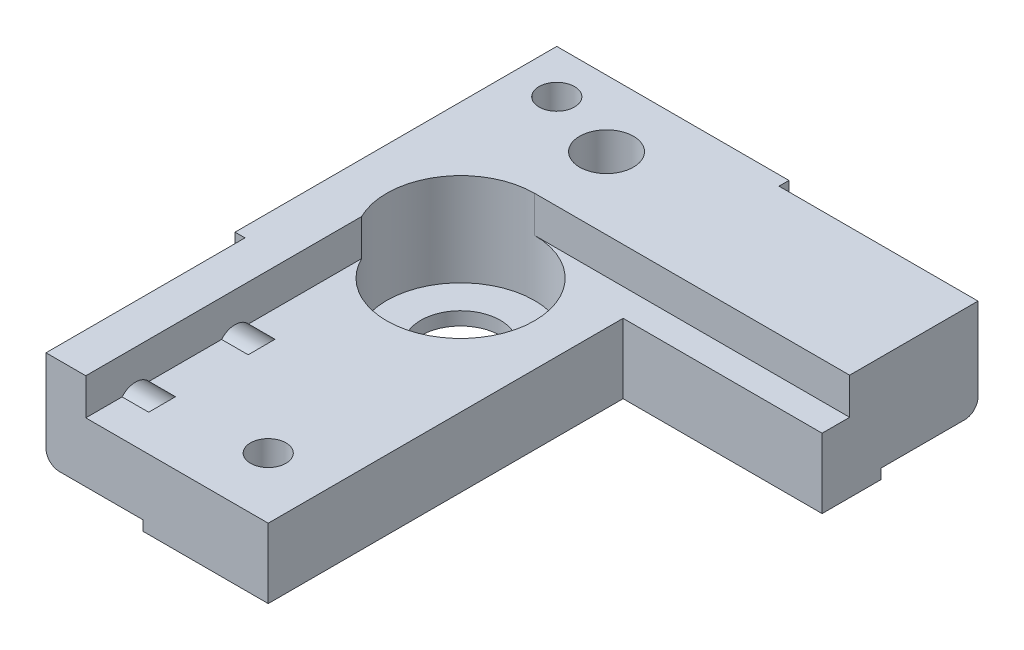
ISO-10303-21;
HEADER;
FILE_DESCRIPTION(('STEP AP214'),'2;1');
FILE_NAME('part.step','',(''),(''),'','','');
FILE_SCHEMA(('AUTOMOTIVE_DESIGN { 1 0 10303 214 1 1 1 1 }'));
ENDSEC;
DATA;
#1=APPLICATION_CONTEXT('core data for automotive mechanical design processes');
#2=APPLICATION_PROTOCOL_DEFINITION('international standard','automotive_design',2000,#1);
#3=PRODUCT_CONTEXT('',#1,'mechanical');
#4=PRODUCT('Part','Part','',(#3));
#5=PRODUCT_RELATED_PRODUCT_CATEGORY('part','',(#4));
#6=PRODUCT_DEFINITION_FORMATION('','',#4);
#7=PRODUCT_DEFINITION_CONTEXT('part definition',#1,'design');
#8=PRODUCT_DEFINITION('design','',#6,#7);
#9=PRODUCT_DEFINITION_SHAPE('','',#8);
#10=(LENGTH_UNIT() NAMED_UNIT(*) SI_UNIT(.MILLI.,.METRE.));
#11=(NAMED_UNIT(*) PLANE_ANGLE_UNIT() SI_UNIT($,.RADIAN.));
#12=(NAMED_UNIT(*) SI_UNIT($,.STERADIAN.) SOLID_ANGLE_UNIT());
#13=UNCERTAINTY_MEASURE_WITH_UNIT(LENGTH_MEASURE(1.E-05),#10,'distance_accuracy_value','');
#14=(GEOMETRIC_REPRESENTATION_CONTEXT(3) GLOBAL_UNCERTAINTY_ASSIGNED_CONTEXT((#13)) GLOBAL_UNIT_ASSIGNED_CONTEXT((#10,
#11,#12)) REPRESENTATION_CONTEXT('',''));
#15=CARTESIAN_POINT('',(0.,0.,0.));
#16=DIRECTION('',(0.,0.,1.));
#17=DIRECTION('',(1.,0.,0.));
#18=AXIS2_PLACEMENT_3D('',#15,#16,#17);
#19=CARTESIAN_POINT('',(35.,16.,78.5));
#20=DIRECTION('',(-1.,0.,0.));
#21=DIRECTION('',(0.,0.,1.));
#22=AXIS2_PLACEMENT_3D('',#19,#20,#21);
#23=PLANE('',#22);
#24=DIRECTION('',(0.,0.,-1.));
#25=VECTOR('',#24,1.);
#26=CARTESIAN_POINT('',(35.,10.5,78.5));
#27=LINE('',#26,#25);
#28=CARTESIAN_POINT('',(35.,10.5,78.5));
#29=VERTEX_POINT('',#28);
#30=CARTESIAN_POINT('',(35.,10.5,25.));
#31=VERTEX_POINT('',#30);
#32=EDGE_CURVE('E207',#29,#31,#27,.T.);
#33=ORIENTED_EDGE('',*,*,#32,.F.);
#34=DIRECTION('',(0.,-1.,0.));
#35=VECTOR('',#34,1.);
#36=CARTESIAN_POINT('',(35.,16.,78.5));
#37=LINE('',#36,#35);
#38=CARTESIAN_POINT('',(35.,0.,78.5));
#39=VERTEX_POINT('',#38);
#40=EDGE_CURVE('E214',#29,#39,#37,.T.);
#41=ORIENTED_EDGE('',*,*,#40,.T.);
#42=DIRECTION('',(0.,0.,-1.));
#43=VECTOR('',#42,1.);
#44=CARTESIAN_POINT('',(35.,0.,78.5));
#45=LINE('',#44,#43);
#46=CARTESIAN_POINT('',(35.,0.,25.));
#47=VERTEX_POINT('',#46);
#48=EDGE_CURVE('E213',#39,#47,#45,.T.);
#49=ORIENTED_EDGE('',*,*,#48,.T.);
#50=DIRECTION('',(0.,-1.,0.));
#51=VECTOR('',#50,1.);
#52=CARTESIAN_POINT('',(35.,16.,25.));
#53=LINE('',#52,#51);
#54=EDGE_CURVE('E199',#31,#47,#53,.T.);
#55=ORIENTED_EDGE('',*,*,#54,.F.);
#56=EDGE_LOOP('',(#33,#41,#49,#55));
#57=FACE_BOUND('',#56,.T.);
#58=ADVANCED_FACE('F35',(#57),#23,.F.);
#59=CARTESIAN_POINT('',(35.,16.,25.));
#60=DIRECTION('',(0.,0.,-1.));
#61=DIRECTION('',(-1.,0.,0.));
#62=AXIS2_PLACEMENT_3D('',#59,#60,#61);
#63=PLANE('',#62);
#64=DIRECTION('',(1.,0.,0.));
#65=VECTOR('',#64,1.);
#66=CARTESIAN_POINT('',(65.,10.5,25.));
#67=LINE('',#66,#65);
#68=CARTESIAN_POINT('',(65.,10.5,25.));
#69=VERTEX_POINT('',#68);
#70=EDGE_CURVE('E195',#31,#69,#67,.T.);
#71=ORIENTED_EDGE('',*,*,#70,.F.);
#72=ORIENTED_EDGE('',*,*,#54,.T.);
#73=DIRECTION('',(1.,0.,0.));
#74=VECTOR('',#73,1.);
#75=CARTESIAN_POINT('',(35.,0.,25.));
#76=LINE('',#75,#74);
#77=CARTESIAN_POINT('',(65.,0.,25.));
#78=VERTEX_POINT('',#77);
#79=EDGE_CURVE('E393',#47,#78,#76,.T.);
#80=ORIENTED_EDGE('',*,*,#79,.T.);
#81=DIRECTION('',(0.,-1.,0.));
#82=VECTOR('',#81,1.);
#83=CARTESIAN_POINT('',(65.,16.,25.));
#84=LINE('',#83,#82);
#85=EDGE_CURVE('E202',#69,#78,#84,.T.);
#86=ORIENTED_EDGE('',*,*,#85,.F.);
#87=EDGE_LOOP('',(#71,#72,#80,#86));
#88=FACE_BOUND('',#87,.T.);
#89=ADVANCED_FACE('F197',(#88),#63,.F.);
#90=CARTESIAN_POINT('',(11.5,8.75,56.));
#91=DIRECTION('',(-1.,0.,0.));
#92=DIRECTION('',(0.,-1.,0.));
#93=AXIS2_PLACEMENT_3D('',#90,#91,#92);
#94=CYLINDRICAL_SURFACE('',#93,2.675);
#95=CARTESIAN_POINT('',(1.5,8.75,56.));
#96=DIRECTION('',(-1.,0.,0.));
#97=DIRECTION('',(0.,-1.,0.));
#98=AXIS2_PLACEMENT_3D('',#95,#96,#97);
#99=CIRCLE('',#98,2.675);
#100=CARTESIAN_POINT('',(1.5,6.075,56.));
#101=VERTEX_POINT('',#100);
#102=EDGE_CURVE('E282',#101,#101,#99,.T.);
#103=ORIENTED_EDGE('',*,*,#102,.T.);
#104=EDGE_LOOP('',(#103));
#105=FACE_BOUND('',#104,.T.);
#106=DIRECTION('',(-1.,0.,0.));
#107=VECTOR('',#106,1.);
#108=CARTESIAN_POINT('',(11.5,10.5,53.9768526993815));
#109=LINE('',#108,#107);
#110=CARTESIAN_POINT('',(7.50000000000001,10.5,53.9768526993815));
#111=VERTEX_POINT('',#110);
#112=CARTESIAN_POINT('',(11.5,10.5,53.9768526993815));
#113=VERTEX_POINT('',#112);
#114=EDGE_CURVE('E258',#111,#113,#109,.F.);
#115=ORIENTED_EDGE('',*,*,#114,.F.);
#116=CARTESIAN_POINT('',(7.50000000000001,8.75,56.));
#117=DIRECTION('',(-1.,0.,0.));
#118=DIRECTION('',(0.,0.,1.));
#119=AXIS2_PLACEMENT_3D('',#116,#117,#118);
#120=CIRCLE('',#119,2.675);
#121=CARTESIAN_POINT('',(7.50000000000001,10.5,58.0231473006185));
#122=VERTEX_POINT('',#121);
#123=EDGE_CURVE('E263',#111,#122,#120,.F.);
#124=ORIENTED_EDGE('',*,*,#123,.T.);
#125=DIRECTION('',(-1.,0.,0.));
#126=VECTOR('',#125,1.);
#127=CARTESIAN_POINT('',(11.5,10.5,58.0231473006185));
#128=LINE('',#127,#126);
#129=CARTESIAN_POINT('',(11.5,10.5,58.0231473006185));
#130=VERTEX_POINT('',#129);
#131=EDGE_CURVE('E255',#130,#122,#128,.T.);
#132=ORIENTED_EDGE('',*,*,#131,.F.);
#133=CARTESIAN_POINT('',(11.5,8.75,56.));
#134=DIRECTION('',(-1.,0.,0.));
#135=DIRECTION('',(0.,-1.,0.));
#136=AXIS2_PLACEMENT_3D('',#133,#134,#135);
#137=CIRCLE('',#136,2.675);
#138=EDGE_CURVE('E285',#113,#130,#137,.T.);
#139=ORIENTED_EDGE('',*,*,#138,.F.);
#140=EDGE_LOOP('',(#115,#124,#132,#139));
#141=FACE_BOUND('',#140,.T.);
#142=ADVANCED_FACE('F497',(#105,#141),#94,.F.);
#143=CARTESIAN_POINT('',(11.5,8.75,56.));
#144=DIRECTION('',(-1.,0.,0.));
#145=DIRECTION('',(0.,-1.,0.));
#146=AXIS2_PLACEMENT_3D('',#143,#144,#145);
#147=PLANE('',#146);
#148=ORIENTED_EDGE('',*,*,#138,.T.);
#149=DIRECTION('',(0.,0.,-1.));
#150=VECTOR('',#149,1.);
#151=CARTESIAN_POINT('',(11.5,10.5,56.));
#152=LINE('',#151,#150);
#153=EDGE_CURVE('E253',#130,#113,#152,.T.);
#154=ORIENTED_EDGE('',*,*,#153,.T.);
#155=EDGE_LOOP('',(#148,#154));
#156=FACE_BOUND('',#155,.T.);
#157=ADVANCED_FACE('F565',(#156),#147,.T.);
#158=CARTESIAN_POINT('',(11.5,8.75,71.));
#159=DIRECTION('',(-1.,0.,0.));
#160=DIRECTION('',(0.,-1.,0.));
#161=AXIS2_PLACEMENT_3D('',#158,#159,#160);
#162=CYLINDRICAL_SURFACE('',#161,2.675);
#163=CARTESIAN_POINT('',(1.5,8.75,71.));
#164=DIRECTION('',(-1.,0.,0.));
#165=DIRECTION('',(0.,-1.,0.));
#166=AXIS2_PLACEMENT_3D('',#163,#164,#165);
#167=CIRCLE('',#166,2.675);
#168=CARTESIAN_POINT('',(1.5,6.075,71.));
#169=VERTEX_POINT('',#168);
#170=EDGE_CURVE('E276',#169,#169,#167,.T.);
#171=ORIENTED_EDGE('',*,*,#170,.T.);
#172=EDGE_LOOP('',(#171));
#173=FACE_BOUND('',#172,.T.);
#174=DIRECTION('',(-1.,0.,0.));
#175=VECTOR('',#174,1.);
#176=CARTESIAN_POINT('',(11.5,10.5,68.9768526993815));
#177=LINE('',#176,#175);
#178=CARTESIAN_POINT('',(7.50000000000001,10.5,68.9768526993815));
#179=VERTEX_POINT('',#178);
#180=CARTESIAN_POINT('',(11.5,10.5,68.9768526993815));
#181=VERTEX_POINT('',#180);
#182=EDGE_CURVE('E250',#179,#181,#177,.F.);
#183=ORIENTED_EDGE('',*,*,#182,.F.);
#184=CARTESIAN_POINT('',(7.50000000000001,8.75,71.));
#185=DIRECTION('',(-1.,0.,0.));
#186=DIRECTION('',(0.,0.,1.));
#187=AXIS2_PLACEMENT_3D('',#184,#185,#186);
#188=CIRCLE('',#187,2.675);
#189=CARTESIAN_POINT('',(7.50000000000001,10.5,73.0231473006185));
#190=VERTEX_POINT('',#189);
#191=EDGE_CURVE('E408',#179,#190,#188,.F.);
#192=ORIENTED_EDGE('',*,*,#191,.T.);
#193=DIRECTION('',(-1.,0.,0.));
#194=VECTOR('',#193,1.);
#195=CARTESIAN_POINT('',(11.5,10.5,73.0231473006185));
#196=LINE('',#195,#194);
#197=CARTESIAN_POINT('',(11.5,10.5,73.0231473006185));
#198=VERTEX_POINT('',#197);
#199=EDGE_CURVE('E247',#198,#190,#196,.T.);
#200=ORIENTED_EDGE('',*,*,#199,.F.);
#201=CARTESIAN_POINT('',(11.5,8.75,71.));
#202=DIRECTION('',(-1.,0.,0.));
#203=DIRECTION('',(0.,-1.,0.));
#204=AXIS2_PLACEMENT_3D('',#201,#202,#203);
#205=CIRCLE('',#204,2.675);
#206=EDGE_CURVE('E279',#181,#198,#205,.T.);
#207=ORIENTED_EDGE('',*,*,#206,.F.);
#208=EDGE_LOOP('',(#183,#192,#200,#207));
#209=FACE_BOUND('',#208,.T.);
#210=ADVANCED_FACE('F569',(#173,#209),#162,.F.);
#211=CARTESIAN_POINT('',(11.5,8.75,71.));
#212=DIRECTION('',(-1.,0.,0.));
#213=DIRECTION('',(0.,-1.,0.));
#214=AXIS2_PLACEMENT_3D('',#211,#212,#213);
#215=PLANE('',#214);
#216=ORIENTED_EDGE('',*,*,#206,.T.);
#217=DIRECTION('',(0.,0.,-1.));
#218=VECTOR('',#217,1.);
#219=CARTESIAN_POINT('',(11.5,10.5,71.));
#220=LINE('',#219,#218);
#221=EDGE_CURVE('E245',#198,#181,#220,.T.);
#222=ORIENTED_EDGE('',*,*,#221,.T.);
#223=EDGE_LOOP('',(#216,#222));
#224=FACE_BOUND('',#223,.T.);
#225=ADVANCED_FACE('F489',(#224),#215,.T.);
#226=CARTESIAN_POINT('',(25.8455481504227,0.,69.3455481504227));
#227=DIRECTION('',(0.,1.,0.));
#228=DIRECTION('',(0.,0.,1.));
#229=AXIS2_PLACEMENT_3D('',#226,#227,#228);
#230=CYLINDRICAL_SURFACE('',#229,2.675);
#231=CARTESIAN_POINT('',(25.8455481504227,0.,69.3455481504227));
#232=DIRECTION('',(0.,1.,0.));
#233=DIRECTION('',(0.,0.,1.));
#234=AXIS2_PLACEMENT_3D('',#231,#232,#233);
#235=CIRCLE('',#234,2.675);
#236=CARTESIAN_POINT('',(25.8455481504227,0.,72.0205481504227));
#237=VERTEX_POINT('',#236);
#238=EDGE_CURVE('E269',#237,#237,#235,.T.);
#239=ORIENTED_EDGE('',*,*,#238,.F.);
#240=EDGE_LOOP('',(#239));
#241=FACE_BOUND('',#240,.T.);
#242=CARTESIAN_POINT('',(25.8455481504227,10.5,69.3455481504227));
#243=DIRECTION('',(0.,1.,0.));
#244=DIRECTION('',(0.,0.,1.));
#245=AXIS2_PLACEMENT_3D('',#242,#243,#244);
#246=CIRCLE('',#245,2.675);
#247=CARTESIAN_POINT('',(25.8455481504227,10.5,72.0205481504227));
#248=VERTEX_POINT('',#247);
#249=EDGE_CURVE('E240',#248,#248,#246,.F.);
#250=ORIENTED_EDGE('',*,*,#249,.F.);
#251=EDGE_LOOP('',(#250));
#252=FACE_BOUND('',#251,.T.);
#253=ADVANCED_FACE('F482',(#241,#252),#230,.F.);
#254=CARTESIAN_POINT('',(0.,16.,0.));
#255=DIRECTION('',(1.,0.,0.));
#256=DIRECTION('',(0.,0.,-1.));
#257=AXIS2_PLACEMENT_3D('',#254,#255,#256);
#258=PLANE('',#257);
#259=DIRECTION('',(0.,0.,1.));
#260=VECTOR('',#259,1.);
#261=CARTESIAN_POINT('',(0.,0.,0.));
#262=LINE('',#261,#260);
#263=CARTESIAN_POINT('',(0.,0.,0.));
#264=VERTEX_POINT('',#263);
#265=CARTESIAN_POINT('',(0.,0.,48.5));
#266=VERTEX_POINT('',#265);
#267=EDGE_CURVE('E372',#264,#266,#262,.T.);
#268=ORIENTED_EDGE('',*,*,#267,.T.);
#269=DIRECTION('',(0.,-1.,0.));
#270=VECTOR('',#269,1.);
#271=CARTESIAN_POINT('',(0.,0.,48.5));
#272=LINE('',#271,#270);
#273=CARTESIAN_POINT('',(0.,16.,48.5));
#274=VERTEX_POINT('',#273);
#275=EDGE_CURVE('E301',#274,#266,#272,.T.);
#276=ORIENTED_EDGE('',*,*,#275,.F.);
#277=DIRECTION('',(0.,0.,1.));
#278=VECTOR('',#277,1.);
#279=CARTESIAN_POINT('',(0.,16.,0.));
#280=LINE('',#279,#278);
#281=CARTESIAN_POINT('',(0.,16.,0.));
#282=VERTEX_POINT('',#281);
#283=EDGE_CURVE('E375',#282,#274,#280,.T.);
#284=ORIENTED_EDGE('',*,*,#283,.F.);
#285=DIRECTION('',(0.,-1.,0.));
#286=VECTOR('',#285,1.);
#287=CARTESIAN_POINT('',(0.,16.,0.));
#288=LINE('',#287,#286);
#289=EDGE_CURVE('E387',#282,#264,#288,.T.);
#290=ORIENTED_EDGE('',*,*,#289,.T.);
#291=EDGE_LOOP('',(#268,#276,#284,#290));
#292=FACE_BOUND('',#291,.T.);
#293=ADVANCED_FACE('F480',(#292),#258,.F.);
#294=CARTESIAN_POINT('',(0.,16.,78.5));
#295=DIRECTION('',(0.,0.,-1.));
#296=DIRECTION('',(-1.,0.,0.));
#297=AXIS2_PLACEMENT_3D('',#294,#295,#296);
#298=PLANE('',#297);
#299=DIRECTION('',(0.,1.,0.));
#300=VECTOR('',#299,1.);
#301=CARTESIAN_POINT('',(1.5,16.1,78.5));
#302=LINE('',#301,#300);
#303=CARTESIAN_POINT('',(1.5,3.5,78.5));
#304=VERTEX_POINT('',#303);
#305=CARTESIAN_POINT('',(1.5,16.,78.5));
#306=VERTEX_POINT('',#305);
#307=EDGE_CURVE('E295',#304,#306,#302,.T.);
#308=ORIENTED_EDGE('',*,*,#307,.F.);
#309=CARTESIAN_POINT('',(3.5,3.5,78.5));
#310=DIRECTION('',(0.,0.,-1.));
#311=DIRECTION('',(-1.,0.,0.));
#312=AXIS2_PLACEMENT_3D('',#309,#310,#311);
#313=CIRCLE('',#312,2.);
#314=CARTESIAN_POINT('',(3.5,1.5,78.5));
#315=VERTEX_POINT('',#314);
#316=EDGE_CURVE('E423',#304,#315,#313,.F.);
#317=ORIENTED_EDGE('',*,*,#316,.T.);
#318=DIRECTION('',(-1.,0.,0.));
#319=VECTOR('',#318,1.);
#320=CARTESIAN_POINT('',(1.5,1.5,78.5));
#321=LINE('',#320,#319);
#322=CARTESIAN_POINT('',(16.1,1.5,78.5));
#323=VERTEX_POINT('',#322);
#324=EDGE_CURVE('E307',#323,#315,#321,.T.);
#325=ORIENTED_EDGE('',*,*,#324,.F.);
#326=DIRECTION('',(0.,1.,0.));
#327=VECTOR('',#326,1.);
#328=CARTESIAN_POINT('',(16.1,1.5,78.5));
#329=LINE('',#328,#327);
#330=CARTESIAN_POINT('',(16.1,0.,78.5));
#331=VERTEX_POINT('',#330);
#332=EDGE_CURVE('E288',#331,#323,#329,.T.);
#333=ORIENTED_EDGE('',*,*,#332,.F.);
#334=DIRECTION('',(1.,0.,0.));
#335=VECTOR('',#334,1.);
#336=CARTESIAN_POINT('',(0.,0.,78.5));
#337=LINE('',#336,#335);
#338=EDGE_CURVE('E390',#331,#39,#337,.T.);
#339=ORIENTED_EDGE('',*,*,#338,.T.);
#340=ORIENTED_EDGE('',*,*,#40,.F.);
#341=DIRECTION('',(1.,0.,0.));
#342=VECTOR('',#341,1.);
#343=CARTESIAN_POINT('',(35.,10.5,78.5));
#344=LINE('',#343,#342);
#345=CARTESIAN_POINT('',(7.50000000000001,10.5,78.5));
#346=VERTEX_POINT('',#345);
#347=EDGE_CURVE('E219',#346,#29,#344,.T.);
#348=ORIENTED_EDGE('',*,*,#347,.F.);
#349=DIRECTION('',(0.,1.,0.));
#350=VECTOR('',#349,1.);
#351=CARTESIAN_POINT('',(7.50000000000001,10.5,78.5));
#352=LINE('',#351,#350);
#353=CARTESIAN_POINT('',(7.50000000000001,16.,78.5));
#354=VERTEX_POINT('',#353);
#355=EDGE_CURVE('E237',#346,#354,#352,.T.);
#356=ORIENTED_EDGE('',*,*,#355,.T.);
#357=DIRECTION('',(1.,0.,0.));
#358=VECTOR('',#357,1.);
#359=CARTESIAN_POINT('',(0.,16.,78.5));
#360=LINE('',#359,#358);
#361=EDGE_CURVE('E378',#306,#354,#360,.T.);
#362=ORIENTED_EDGE('',*,*,#361,.F.);
#363=EDGE_LOOP('',(#308,#317,#325,#333,#339,#340,#348,#356,#362));
#364=FACE_BOUND('',#363,.T.);
#365=ADVANCED_FACE('F471',(#364),#298,.F.);
#366=CARTESIAN_POINT('',(65.,16.,0.));
#367=DIRECTION('',(-1.,0.,0.));
#368=DIRECTION('',(0.,0.,1.));
#369=AXIS2_PLACEMENT_3D('',#366,#367,#368);
#370=PLANE('',#369);
#371=DIRECTION('',(0.,0.,1.));
#372=VECTOR('',#371,1.);
#373=CARTESIAN_POINT('',(65.,1.5,16.1));
#374=LINE('',#373,#372);
#375=CARTESIAN_POINT('',(65.,1.5,3.49999999999999));
#376=VERTEX_POINT('',#375);
#377=CARTESIAN_POINT('',(65.,1.5,16.1));
#378=VERTEX_POINT('',#377);
#379=EDGE_CURVE('E345',#376,#378,#374,.T.);
#380=ORIENTED_EDGE('',*,*,#379,.F.);
#381=CARTESIAN_POINT('',(65.,3.5,3.49999999999999));
#382=DIRECTION('',(-1.,0.,0.));
#383=DIRECTION('',(0.,0.,1.));
#384=AXIS2_PLACEMENT_3D('',#381,#382,#383);
#385=CIRCLE('',#384,2.);
#386=CARTESIAN_POINT('',(65.,3.5,1.49999999999999));
#387=VERTEX_POINT('',#386);
#388=EDGE_CURVE('E415',#376,#387,#385,.F.);
#389=ORIENTED_EDGE('',*,*,#388,.T.);
#390=DIRECTION('',(0.,-1.,0.));
#391=VECTOR('',#390,1.);
#392=CARTESIAN_POINT('',(65.,1.5,1.49999999999999));
#393=LINE('',#392,#391);
#394=CARTESIAN_POINT('',(65.,16.,1.49999999999999));
#395=VERTEX_POINT('',#394);
#396=EDGE_CURVE('E326',#395,#387,#393,.T.);
#397=ORIENTED_EDGE('',*,*,#396,.F.);
#398=DIRECTION('',(0.,0.,-1.));
#399=VECTOR('',#398,1.);
#400=CARTESIAN_POINT('',(65.,16.,0.));
#401=LINE('',#400,#399);
#402=CARTESIAN_POINT('',(65.,16.,20.85));
#403=VERTEX_POINT('',#402);
#404=EDGE_CURVE('E382',#403,#395,#401,.T.);
#405=ORIENTED_EDGE('',*,*,#404,.F.);
#406=DIRECTION('',(0.,1.,0.));
#407=VECTOR('',#406,1.);
#408=CARTESIAN_POINT('',(65.,10.5,20.85));
#409=LINE('',#408,#407);
#410=CARTESIAN_POINT('',(65.,10.5,20.85));
#411=VERTEX_POINT('',#410);
#412=EDGE_CURVE('E234',#411,#403,#409,.T.);
#413=ORIENTED_EDGE('',*,*,#412,.F.);
#414=DIRECTION('',(0.,0.,-1.));
#415=VECTOR('',#414,1.);
#416=CARTESIAN_POINT('',(65.,10.5,20.85));
#417=LINE('',#416,#415);
#418=EDGE_CURVE('E206',#69,#411,#417,.T.);
#419=ORIENTED_EDGE('',*,*,#418,.F.);
#420=ORIENTED_EDGE('',*,*,#85,.T.);
#421=DIRECTION('',(0.,0.,-1.));
#422=VECTOR('',#421,1.);
#423=CARTESIAN_POINT('',(65.,0.,0.));
#424=LINE('',#423,#422);
#425=CARTESIAN_POINT('',(65.,0.,16.1));
#426=VERTEX_POINT('',#425);
#427=EDGE_CURVE('E395',#78,#426,#424,.T.);
#428=ORIENTED_EDGE('',*,*,#427,.T.);
#429=DIRECTION('',(0.,-1.,0.));
#430=VECTOR('',#429,1.);
#431=CARTESIAN_POINT('',(65.,0.,16.1));
#432=LINE('',#431,#430);
#433=EDGE_CURVE('E332',#378,#426,#432,.T.);
#434=ORIENTED_EDGE('',*,*,#433,.F.);
#435=EDGE_LOOP('',(#380,#389,#397,#405,#413,#419,#420,#428,#434));
#436=FACE_BOUND('',#435,.T.);
#437=ADVANCED_FACE('F466',(#436),#370,.F.);
#438=CARTESIAN_POINT('',(0.,16.,0.));
#439=DIRECTION('',(0.,0.,1.));
#440=DIRECTION('',(1.,0.,0.));
#441=AXIS2_PLACEMENT_3D('',#438,#439,#440);
#442=PLANE('',#441);
#443=DIRECTION('',(-1.,0.,0.));
#444=VECTOR('',#443,1.);
#445=CARTESIAN_POINT('',(0.,16.,0.));
#446=LINE('',#445,#444);
#447=CARTESIAN_POINT('',(35.,16.,0.));
#448=VERTEX_POINT('',#447);
#449=EDGE_CURVE('E385',#448,#282,#446,.T.);
#450=ORIENTED_EDGE('',*,*,#449,.F.);
#451=DIRECTION('',(0.,1.,0.));
#452=VECTOR('',#451,1.);
#453=CARTESIAN_POINT('',(35.,16.1,0.));
#454=LINE('',#453,#452);
#455=CARTESIAN_POINT('',(35.,0.,0.));
#456=VERTEX_POINT('',#455);
#457=EDGE_CURVE('E331',#456,#448,#454,.T.);
#458=ORIENTED_EDGE('',*,*,#457,.F.);
#459=DIRECTION('',(-1.,0.,0.));
#460=VECTOR('',#459,1.);
#461=CARTESIAN_POINT('',(0.,0.,0.));
#462=LINE('',#461,#460);
#463=EDGE_CURVE('E379',#456,#264,#462,.T.);
#464=ORIENTED_EDGE('',*,*,#463,.T.);
#465=ORIENTED_EDGE('',*,*,#289,.F.);
#466=EDGE_LOOP('',(#450,#458,#464,#465));
#467=FACE_BOUND('',#466,.T.);
#468=ADVANCED_FACE('F452',(#467),#442,.F.);
#469=CARTESIAN_POINT('',(0.,16.,0.));
#470=DIRECTION('',(0.,1.,0.));
#471=DIRECTION('',(0.,0.,1.));
#472=AXIS2_PLACEMENT_3D('',#469,#470,#471);
#473=PLANE('',#472);
#474=DIRECTION('',(0.,0.,1.));
#475=VECTOR('',#474,1.);
#476=CARTESIAN_POINT('',(7.50000000000001,16.,78.5));
#477=LINE('',#476,#475);
#478=CARTESIAN_POINT('',(7.50000000000001,16.,36.9317846668321));
#479=VERTEX_POINT('',#478);
#480=EDGE_CURVE('E221',#479,#354,#477,.T.);
#481=ORIENTED_EDGE('',*,*,#480,.F.);
#482=CARTESIAN_POINT('',(17.5,16.,32.));
#483=DIRECTION('',(0.,1.,0.));
#484=DIRECTION('',(0.,0.,1.));
#485=AXIS2_PLACEMENT_3D('',#482,#483,#484);
#486=CIRCLE('',#485,11.15);
#487=CARTESIAN_POINT('',(17.5,16.,20.85));
#488=VERTEX_POINT('',#487);
#489=EDGE_CURVE('E366',#488,#479,#486,.T.);
#490=ORIENTED_EDGE('',*,*,#489,.F.);
#491=DIRECTION('',(-1.,0.,0.));
#492=VECTOR('',#491,1.);
#493=CARTESIAN_POINT('',(17.5,16.,20.85));
#494=LINE('',#493,#492);
#495=EDGE_CURVE('E223',#403,#488,#494,.T.);
#496=ORIENTED_EDGE('',*,*,#495,.F.);
#497=ORIENTED_EDGE('',*,*,#404,.T.);
#498=DIRECTION('',(1.,0.,0.));
#499=VECTOR('',#498,1.);
#500=CARTESIAN_POINT('',(0.,16.,1.49999999999999));
#501=LINE('',#500,#499);
#502=CARTESIAN_POINT('',(35.,16.,1.49999999999999));
#503=VERTEX_POINT('',#502);
#504=EDGE_CURVE('E403',#503,#395,#501,.T.);
#505=ORIENTED_EDGE('',*,*,#504,.F.);
#506=DIRECTION('',(0.,0.,1.));
#507=VECTOR('',#506,1.);
#508=CARTESIAN_POINT('',(35.,16.,0.));
#509=LINE('',#508,#507);
#510=EDGE_CURVE('E352',#448,#503,#509,.T.);
#511=ORIENTED_EDGE('',*,*,#510,.F.);
#512=ORIENTED_EDGE('',*,*,#449,.T.);
#513=ORIENTED_EDGE('',*,*,#283,.T.);
#514=DIRECTION('',(-1.,0.,0.));
#515=VECTOR('',#514,1.);
#516=CARTESIAN_POINT('',(0.,16.,48.5));
#517=LINE('',#516,#515);
#518=CARTESIAN_POINT('',(1.5,16.,48.5));
#519=VERTEX_POINT('',#518);
#520=EDGE_CURVE('E313',#519,#274,#517,.T.);
#521=ORIENTED_EDGE('',*,*,#520,.F.);
#522=DIRECTION('',(0.,0.,-1.));
#523=VECTOR('',#522,1.);
#524=CARTESIAN_POINT('',(1.5,16.,0.));
#525=LINE('',#524,#523);
#526=EDGE_CURVE('E405',#306,#519,#525,.T.);
#527=ORIENTED_EDGE('',*,*,#526,.F.);
#528=ORIENTED_EDGE('',*,*,#361,.T.);
#529=EDGE_LOOP('',(#481,#490,#496,#497,#505,#511,#512,#513,#521,#527,#528));
#530=FACE_BOUND('',#529,.T.);
#531=CARTESIAN_POINT('',(6.58093689720364,16.,6.58093689720363));
#532=DIRECTION('',(0.,1.,0.));
#533=DIRECTION('',(0.,0.,1.));
#534=AXIS2_PLACEMENT_3D('',#531,#532,#533);
#535=CIRCLE('',#534,2.675);
#536=CARTESIAN_POINT('',(6.58093689720364,16.,9.25593689720364));
#537=VERTEX_POINT('',#536);
#538=EDGE_CURVE('E272',#537,#537,#535,.T.);
#539=ORIENTED_EDGE('',*,*,#538,.F.);
#540=EDGE_LOOP('',(#539));
#541=FACE_BOUND('',#540,.T.);
#542=CARTESIAN_POINT('',(17.5,16.,10.));
#543=DIRECTION('',(0.,1.,0.));
#544=DIRECTION('',(0.,0.,1.));
#545=AXIS2_PLACEMENT_3D('',#542,#543,#544);
#546=CIRCLE('',#545,4.04999999999999);
#547=CARTESIAN_POINT('',(17.5,16.,14.05));
#548=VERTEX_POINT('',#547);
#549=EDGE_CURVE('E356',#548,#548,#546,.T.);
#550=ORIENTED_EDGE('',*,*,#549,.F.);
#551=EDGE_LOOP('',(#550));
#552=FACE_BOUND('',#551,.T.);
#553=ADVANCED_FACE('F456',(#530,#541,#552),#473,.T.);
#554=CARTESIAN_POINT('',(0.,0.,0.));
#555=DIRECTION('',(0.,1.,0.));
#556=DIRECTION('',(0.,0.,1.));
#557=AXIS2_PLACEMENT_3D('',#554,#555,#556);
#558=PLANE('',#557);
#559=ORIENTED_EDGE('',*,*,#238,.T.);
#560=EDGE_LOOP('',(#559));
#561=FACE_BOUND('',#560,.T.);
#562=CARTESIAN_POINT('',(6.58093689720364,0.,6.58093689720363));
#563=DIRECTION('',(0.,1.,0.));
#564=DIRECTION('',(0.,0.,1.));
#565=AXIS2_PLACEMENT_3D('',#562,#563,#564);
#566=CIRCLE('',#565,2.675);
#567=CARTESIAN_POINT('',(6.58093689720364,0.,9.25593689720364));
#568=VERTEX_POINT('',#567);
#569=EDGE_CURVE('E273',#568,#568,#566,.T.);
#570=ORIENTED_EDGE('',*,*,#569,.T.);
#571=EDGE_LOOP('',(#570));
#572=FACE_BOUND('',#571,.T.);
#573=CARTESIAN_POINT('',(17.5,0.,10.));
#574=DIRECTION('',(0.,1.,0.));
#575=DIRECTION('',(0.,0.,1.));
#576=AXIS2_PLACEMENT_3D('',#573,#574,#575);
#577=CIRCLE('',#576,4.04999999999999);
#578=CARTESIAN_POINT('',(17.5,0.,14.05));
#579=VERTEX_POINT('',#578);
#580=EDGE_CURVE('E357',#579,#579,#577,.T.);
#581=ORIENTED_EDGE('',*,*,#580,.T.);
#582=EDGE_LOOP('',(#581));
#583=FACE_BOUND('',#582,.T.);
#584=CARTESIAN_POINT('',(17.5,0.,32.));
#585=DIRECTION('',(0.,1.,0.));
#586=DIRECTION('',(0.,0.,1.));
#587=AXIS2_PLACEMENT_3D('',#584,#585,#586);
#588=CIRCLE('',#587,6.);
#589=CARTESIAN_POINT('',(17.5,0.,38.));
#590=VERTEX_POINT('',#589);
#591=EDGE_CURVE('E363',#590,#590,#588,.T.);
#592=ORIENTED_EDGE('',*,*,#591,.T.);
#593=EDGE_LOOP('',(#592));
#594=FACE_BOUND('',#593,.T.);
#595=ORIENTED_EDGE('',*,*,#338,.F.);
#596=DIRECTION('',(0.,0.,1.));
#597=VECTOR('',#596,1.);
#598=CARTESIAN_POINT('',(16.1,0.,48.5));
#599=LINE('',#598,#597);
#600=CARTESIAN_POINT('',(16.1,0.,48.5));
#601=VERTEX_POINT('',#600);
#602=EDGE_CURVE('E304',#601,#331,#599,.T.);
#603=ORIENTED_EDGE('',*,*,#602,.F.);
#604=DIRECTION('',(1.,0.,0.));
#605=VECTOR('',#604,1.);
#606=CARTESIAN_POINT('',(16.1,0.,48.5));
#607=LINE('',#606,#605);
#608=EDGE_CURVE('E291',#266,#601,#607,.T.);
#609=ORIENTED_EDGE('',*,*,#608,.F.);
#610=ORIENTED_EDGE('',*,*,#267,.F.);
#611=ORIENTED_EDGE('',*,*,#463,.F.);
#612=DIRECTION('',(0.,0.,-1.));
#613=VECTOR('',#612,1.);
#614=CARTESIAN_POINT('',(35.,0.,0.));
#615=LINE('',#614,#613);
#616=CARTESIAN_POINT('',(35.,0.,16.1));
#617=VERTEX_POINT('',#616);
#618=EDGE_CURVE('E329',#617,#456,#615,.T.);
#619=ORIENTED_EDGE('',*,*,#618,.F.);
#620=DIRECTION('',(1.,0.,0.));
#621=VECTOR('',#620,1.);
#622=CARTESIAN_POINT('',(35.,0.,16.1));
#623=LINE('',#622,#621);
#624=EDGE_CURVE('E350',#617,#426,#623,.T.);
#625=ORIENTED_EDGE('',*,*,#624,.T.);
#626=ORIENTED_EDGE('',*,*,#427,.F.);
#627=ORIENTED_EDGE('',*,*,#79,.F.);
#628=ORIENTED_EDGE('',*,*,#48,.F.);
#629=EDGE_LOOP('',(#595,#603,#609,#610,#611,#619,#625,#626,#627,#628));
#630=FACE_BOUND('',#629,.T.);
#631=ADVANCED_FACE('F449',(#561,#572,#583,#594,#630),#558,.F.);
#632=CARTESIAN_POINT('',(17.5,2.,32.));
#633=DIRECTION('',(0.,1.,0.));
#634=DIRECTION('',(0.,0.,1.));
#635=AXIS2_PLACEMENT_3D('',#632,#633,#634);
#636=CYLINDRICAL_SURFACE('',#635,11.15);
#637=ORIENTED_EDGE('',*,*,#489,.T.);
#638=DIRECTION('',(0.,1.,0.));
#639=VECTOR('',#638,1.);
#640=CARTESIAN_POINT('',(7.50000000000001,2.,36.9317846668321));
#641=LINE('',#640,#639);
#642=CARTESIAN_POINT('',(7.50000000000001,10.5,36.9317846668321));
#643=VERTEX_POINT('',#642);
#644=EDGE_CURVE('E266',#479,#643,#641,.F.);
#645=ORIENTED_EDGE('',*,*,#644,.T.);
#646=CARTESIAN_POINT('',(17.5,10.5,32.));
#647=DIRECTION('',(0.,1.,0.));
#648=DIRECTION('',(0.,0.,1.));
#649=AXIS2_PLACEMENT_3D('',#646,#647,#648);
#650=CIRCLE('',#649,11.15);
#651=CARTESIAN_POINT('',(17.5,10.5,20.85));
#652=VERTEX_POINT('',#651);
#653=EDGE_CURVE('E261',#652,#643,#650,.F.);
#654=ORIENTED_EDGE('',*,*,#653,.F.);
#655=DIRECTION('',(0.,1.,0.));
#656=VECTOR('',#655,1.);
#657=CARTESIAN_POINT('',(17.5,10.5,20.85));
#658=LINE('',#657,#656);
#659=EDGE_CURVE('E241',#652,#488,#658,.T.);
#660=ORIENTED_EDGE('',*,*,#659,.T.);
#661=EDGE_LOOP('',(#637,#645,#654,#660));
#662=FACE_BOUND('',#661,.T.);
#663=CARTESIAN_POINT('',(17.5,2.,32.));
#664=DIRECTION('',(0.,1.,0.));
#665=DIRECTION('',(0.,0.,1.));
#666=AXIS2_PLACEMENT_3D('',#663,#664,#665);
#667=CIRCLE('',#666,11.15);
#668=CARTESIAN_POINT('',(17.5,2.,43.15));
#669=VERTEX_POINT('',#668);
#670=EDGE_CURVE('E369',#669,#669,#667,.T.);
#671=ORIENTED_EDGE('',*,*,#670,.F.);
#672=EDGE_LOOP('',(#671));
#673=FACE_BOUND('',#672,.T.);
#674=ADVANCED_FACE('F506',(#662,#673),#636,.F.);
#675=CARTESIAN_POINT('',(17.5,2.,32.));
#676=DIRECTION('',(0.,1.,0.));
#677=DIRECTION('',(0.,0.,1.));
#678=AXIS2_PLACEMENT_3D('',#675,#676,#677);
#679=PLANE('',#678);
#680=CARTESIAN_POINT('',(17.5,2.,32.));
#681=DIRECTION('',(0.,1.,0.));
#682=DIRECTION('',(0.,0.,1.));
#683=AXIS2_PLACEMENT_3D('',#680,#681,#682);
#684=CIRCLE('',#683,6.);
#685=CARTESIAN_POINT('',(17.5,2.,38.));
#686=VERTEX_POINT('',#685);
#687=EDGE_CURVE('E360',#686,#686,#684,.T.);
#688=ORIENTED_EDGE('',*,*,#687,.F.);
#689=EDGE_LOOP('',(#688));
#690=FACE_BOUND('',#689,.T.);
#691=ORIENTED_EDGE('',*,*,#670,.T.);
#692=EDGE_LOOP('',(#691));
#693=FACE_BOUND('',#692,.T.);
#694=ADVANCED_FACE('F512',(#690,#693),#679,.T.);
#695=CARTESIAN_POINT('',(17.5,0.,32.));
#696=DIRECTION('',(0.,1.,0.));
#697=DIRECTION('',(0.,0.,1.));
#698=AXIS2_PLACEMENT_3D('',#695,#696,#697);
#699=CYLINDRICAL_SURFACE('',#698,6.);
#700=ORIENTED_EDGE('',*,*,#591,.F.);
#701=EDGE_LOOP('',(#700));
#702=FACE_BOUND('',#701,.T.);
#703=ORIENTED_EDGE('',*,*,#687,.T.);
#704=EDGE_LOOP('',(#703));
#705=FACE_BOUND('',#704,.T.);
#706=ADVANCED_FACE('F516',(#702,#705),#699,.F.);
#707=CARTESIAN_POINT('',(17.5,0.,10.));
#708=DIRECTION('',(0.,1.,0.));
#709=DIRECTION('',(0.,0.,1.));
#710=AXIS2_PLACEMENT_3D('',#707,#708,#709);
#711=CYLINDRICAL_SURFACE('',#710,4.04999999999999);
#712=ORIENTED_EDGE('',*,*,#580,.F.);
#713=EDGE_LOOP('',(#712));
#714=FACE_BOUND('',#713,.T.);
#715=ORIENTED_EDGE('',*,*,#549,.T.);
#716=EDGE_LOOP('',(#715));
#717=FACE_BOUND('',#716,.T.);
#718=ADVANCED_FACE('F520',(#714,#717),#711,.F.);
#719=CARTESIAN_POINT('',(35.,0.,16.1));
#720=DIRECTION('',(0.,0.,1.));
#721=DIRECTION('',(1.,0.,0.));
#722=AXIS2_PLACEMENT_3D('',#719,#720,#721);
#723=PLANE('',#722);
#724=ORIENTED_EDGE('',*,*,#433,.T.);
#725=ORIENTED_EDGE('',*,*,#624,.F.);
#726=DIRECTION('',(0.,-1.,0.));
#727=VECTOR('',#726,1.);
#728=CARTESIAN_POINT('',(35.,0.,16.1));
#729=LINE('',#728,#727);
#730=CARTESIAN_POINT('',(35.,1.5,16.1));
#731=VERTEX_POINT('',#730);
#732=EDGE_CURVE('E340',#731,#617,#729,.T.);
#733=ORIENTED_EDGE('',*,*,#732,.F.);
#734=DIRECTION('',(1.,0.,0.));
#735=VECTOR('',#734,1.);
#736=CARTESIAN_POINT('',(35.,1.5,16.1));
#737=LINE('',#736,#735);
#738=EDGE_CURVE('E342',#731,#378,#737,.T.);
#739=ORIENTED_EDGE('',*,*,#738,.T.);
#740=EDGE_LOOP('',(#724,#725,#733,#739));
#741=FACE_BOUND('',#740,.T.);
#742=ADVANCED_FACE('F441',(#741),#723,.F.);
#743=CARTESIAN_POINT('',(35.,1.5,16.1));
#744=DIRECTION('',(0.,1.,0.));
#745=DIRECTION('',(0.,0.,1.));
#746=AXIS2_PLACEMENT_3D('',#743,#744,#745);
#747=PLANE('',#746);
#748=DIRECTION('',(0.,0.,1.));
#749=VECTOR('',#748,1.);
#750=CARTESIAN_POINT('',(35.,1.5,16.1));
#751=LINE('',#750,#749);
#752=CARTESIAN_POINT('',(35.,1.5,3.49999999999999));
#753=VERTEX_POINT('',#752);
#754=EDGE_CURVE('E338',#753,#731,#751,.T.);
#755=ORIENTED_EDGE('',*,*,#754,.F.);
#756=DIRECTION('',(1.,0.,0.));
#757=VECTOR('',#756,1.);
#758=CARTESIAN_POINT('',(35.,1.5,3.49999999999999));
#759=LINE('',#758,#757);
#760=EDGE_CURVE('E413',#753,#376,#759,.T.);
#761=ORIENTED_EDGE('',*,*,#760,.T.);
#762=ORIENTED_EDGE('',*,*,#379,.T.);
#763=ORIENTED_EDGE('',*,*,#738,.F.);
#764=EDGE_LOOP('',(#755,#761,#762,#763));
#765=FACE_BOUND('',#764,.T.);
#766=ADVANCED_FACE('F436',(#765),#747,.F.);
#767=CARTESIAN_POINT('',(35.,1.5,1.49999999999999));
#768=DIRECTION('',(0.,0.,1.));
#769=DIRECTION('',(1.,0.,0.));
#770=AXIS2_PLACEMENT_3D('',#767,#768,#769);
#771=PLANE('',#770);
#772=CARTESIAN_POINT('',(57.5,8.75,1.49999999999999));
#773=DIRECTION('',(0.,0.,-1.));
#774=DIRECTION('',(-1.,0.,0.));
#775=AXIS2_PLACEMENT_3D('',#772,#773,#774);
#776=CIRCLE('',#775,2.675);
#777=CARTESIAN_POINT('',(54.825,8.75,1.49999999999999));
#778=VERTEX_POINT('',#777);
#779=EDGE_CURVE('E316',#778,#778,#776,.T.);
#780=ORIENTED_EDGE('',*,*,#779,.F.);
#781=EDGE_LOOP('',(#780));
#782=FACE_BOUND('',#781,.T.);
#783=CARTESIAN_POINT('',(42.5,8.75,1.49999999999999));
#784=DIRECTION('',(0.,0.,-1.));
#785=DIRECTION('',(-1.,0.,0.));
#786=AXIS2_PLACEMENT_3D('',#783,#784,#785);
#787=CIRCLE('',#786,2.675);
#788=CARTESIAN_POINT('',(39.825,8.75,1.49999999999999));
#789=VERTEX_POINT('',#788);
#790=EDGE_CURVE('E320',#789,#789,#787,.T.);
#791=ORIENTED_EDGE('',*,*,#790,.F.);
#792=EDGE_LOOP('',(#791));
#793=FACE_BOUND('',#792,.T.);
#794=ORIENTED_EDGE('',*,*,#396,.T.);
#795=DIRECTION('',(1.,0.,0.));
#796=VECTOR('',#795,1.);
#797=CARTESIAN_POINT('',(35.,3.5,1.49999999999999));
#798=LINE('',#797,#796);
#799=CARTESIAN_POINT('',(35.,3.5,1.49999999999999));
#800=VERTEX_POINT('',#799);
#801=EDGE_CURVE('E418',#387,#800,#798,.F.);
#802=ORIENTED_EDGE('',*,*,#801,.T.);
#803=DIRECTION('',(0.,-1.,0.));
#804=VECTOR('',#803,1.);
#805=CARTESIAN_POINT('',(35.,1.5,1.49999999999999));
#806=LINE('',#805,#804);
#807=EDGE_CURVE('E335',#503,#800,#806,.T.);
#808=ORIENTED_EDGE('',*,*,#807,.F.);
#809=ORIENTED_EDGE('',*,*,#504,.T.);
#810=EDGE_LOOP('',(#794,#802,#808,#809));
#811=FACE_BOUND('',#810,.T.);
#812=ADVANCED_FACE('F464',(#782,#793,#811),#771,.F.);
#813=CARTESIAN_POINT('',(35.,0.,0.));
#814=DIRECTION('',(-1.,0.,0.));
#815=DIRECTION('',(0.,0.,1.));
#816=AXIS2_PLACEMENT_3D('',#813,#814,#815);
#817=PLANE('',#816);
#818=ORIENTED_EDGE('',*,*,#510,.T.);
#819=ORIENTED_EDGE('',*,*,#807,.T.);
#820=CARTESIAN_POINT('',(35.,3.5,3.49999999999999));
#821=DIRECTION('',(-1.,0.,0.));
#822=DIRECTION('',(0.,0.,1.));
#823=AXIS2_PLACEMENT_3D('',#820,#821,#822);
#824=CIRCLE('',#823,2.);
#825=EDGE_CURVE('E43',#800,#753,#824,.T.);
#826=ORIENTED_EDGE('',*,*,#825,.T.);
#827=ORIENTED_EDGE('',*,*,#754,.T.);
#828=ORIENTED_EDGE('',*,*,#732,.T.);
#829=ORIENTED_EDGE('',*,*,#618,.T.);
#830=ORIENTED_EDGE('',*,*,#457,.T.);
#831=EDGE_LOOP('',(#818,#819,#826,#827,#828,#829,#830));
#832=FACE_BOUND('',#831,.T.);
#833=ADVANCED_FACE('F428',(#832),#817,.F.);
#834=CARTESIAN_POINT('',(42.5,8.75,16.5));
#835=DIRECTION('',(0.,0.,-1.));
#836=DIRECTION('',(-1.,0.,0.));
#837=AXIS2_PLACEMENT_3D('',#834,#835,#836);
#838=CYLINDRICAL_SURFACE('',#837,2.675);
#839=CARTESIAN_POINT('',(42.5,8.75,16.5));
#840=DIRECTION('',(0.,0.,-1.));
#841=DIRECTION('',(-1.,0.,0.));
#842=AXIS2_PLACEMENT_3D('',#839,#840,#841);
#843=CIRCLE('',#842,2.675);
#844=CARTESIAN_POINT('',(39.825,8.75,16.5));
#845=VERTEX_POINT('',#844);
#846=EDGE_CURVE('E323',#845,#845,#843,.T.);
#847=ORIENTED_EDGE('',*,*,#846,.F.);
#848=EDGE_LOOP('',(#847));
#849=FACE_BOUND('',#848,.T.);
#850=ORIENTED_EDGE('',*,*,#790,.T.);
#851=EDGE_LOOP('',(#850));
#852=FACE_BOUND('',#851,.T.);
#853=ADVANCED_FACE('F534',(#849,#852),#838,.F.);
#854=CARTESIAN_POINT('',(42.5,8.75,16.5));
#855=DIRECTION('',(0.,0.,-1.));
#856=DIRECTION('',(-1.,0.,0.));
#857=AXIS2_PLACEMENT_3D('',#854,#855,#856);
#858=PLANE('',#857);
#859=ORIENTED_EDGE('',*,*,#846,.T.);
#860=EDGE_LOOP('',(#859));
#861=FACE_BOUND('',#860,.T.);
#862=ADVANCED_FACE('F537',(#861),#858,.T.);
#863=CARTESIAN_POINT('',(57.5,8.75,16.5));
#864=DIRECTION('',(0.,0.,-1.));
#865=DIRECTION('',(-1.,0.,0.));
#866=AXIS2_PLACEMENT_3D('',#863,#864,#865);
#867=CYLINDRICAL_SURFACE('',#866,2.675);
#868=CARTESIAN_POINT('',(57.5,8.75,16.5));
#869=DIRECTION('',(0.,0.,-1.));
#870=DIRECTION('',(-1.,0.,0.));
#871=AXIS2_PLACEMENT_3D('',#868,#869,#870);
#872=CIRCLE('',#871,2.675);
#873=CARTESIAN_POINT('',(54.825,8.75,16.5));
#874=VERTEX_POINT('',#873);
#875=EDGE_CURVE('E317',#874,#874,#872,.T.);
#876=ORIENTED_EDGE('',*,*,#875,.F.);
#877=EDGE_LOOP('',(#876));
#878=FACE_BOUND('',#877,.T.);
#879=ORIENTED_EDGE('',*,*,#779,.T.);
#880=EDGE_LOOP('',(#879));
#881=FACE_BOUND('',#880,.T.);
#882=ADVANCED_FACE('F541',(#878,#881),#867,.F.);
#883=CARTESIAN_POINT('',(57.5,8.75,16.5));
#884=DIRECTION('',(0.,0.,-1.));
#885=DIRECTION('',(-1.,0.,0.));
#886=AXIS2_PLACEMENT_3D('',#883,#884,#885);
#887=PLANE('',#886);
#888=ORIENTED_EDGE('',*,*,#875,.T.);
#889=EDGE_LOOP('',(#888));
#890=FACE_BOUND('',#889,.T.);
#891=ADVANCED_FACE('F545',(#890),#887,.T.);
#892=CARTESIAN_POINT('',(1.5,16.1,48.5));
#893=DIRECTION('',(1.,0.,0.));
#894=DIRECTION('',(0.,1.,0.));
#895=AXIS2_PLACEMENT_3D('',#892,#893,#894);
#896=PLANE('',#895);
#897=ORIENTED_EDGE('',*,*,#170,.F.);
#898=EDGE_LOOP('',(#897));
#899=FACE_BOUND('',#898,.T.);
#900=ORIENTED_EDGE('',*,*,#102,.F.);
#901=EDGE_LOOP('',(#900));
#902=FACE_BOUND('',#901,.T.);
#903=DIRECTION('',(0.,1.,0.));
#904=VECTOR('',#903,1.);
#905=CARTESIAN_POINT('',(1.5,16.1,48.5));
#906=LINE('',#905,#904);
#907=CARTESIAN_POINT('',(1.5,3.5,48.5));
#908=VERTEX_POINT('',#907);
#909=EDGE_CURVE('E299',#908,#519,#906,.T.);
#910=ORIENTED_EDGE('',*,*,#909,.F.);
#911=DIRECTION('',(0.,0.,1.));
#912=VECTOR('',#911,1.);
#913=CARTESIAN_POINT('',(1.5,3.5,48.5));
#914=LINE('',#913,#912);
#915=EDGE_CURVE('E421',#908,#304,#914,.T.);
#916=ORIENTED_EDGE('',*,*,#915,.T.);
#917=ORIENTED_EDGE('',*,*,#307,.T.);
#918=ORIENTED_EDGE('',*,*,#526,.T.);
#919=EDGE_LOOP('',(#910,#916,#917,#918));
#920=FACE_BOUND('',#919,.T.);
#921=ADVANCED_FACE('F549',(#899,#902,#920),#896,.F.);
#922=CARTESIAN_POINT('',(1.5,1.5,48.5));
#923=DIRECTION('',(0.,1.,0.));
#924=DIRECTION('',(0.,0.,1.));
#925=AXIS2_PLACEMENT_3D('',#922,#923,#924);
#926=PLANE('',#925);
#927=ORIENTED_EDGE('',*,*,#324,.T.);
#928=DIRECTION('',(0.,0.,1.));
#929=VECTOR('',#928,1.);
#930=CARTESIAN_POINT('',(3.5,1.5,48.5));
#931=LINE('',#930,#929);
#932=CARTESIAN_POINT('',(3.5,1.5,48.5));
#933=VERTEX_POINT('',#932);
#934=EDGE_CURVE('E53',#315,#933,#931,.F.);
#935=ORIENTED_EDGE('',*,*,#934,.T.);
#936=DIRECTION('',(-1.,0.,0.));
#937=VECTOR('',#936,1.);
#938=CARTESIAN_POINT('',(1.5,1.5,48.5));
#939=LINE('',#938,#937);
#940=CARTESIAN_POINT('',(16.1,1.5,48.5));
#941=VERTEX_POINT('',#940);
#942=EDGE_CURVE('E297',#941,#933,#939,.T.);
#943=ORIENTED_EDGE('',*,*,#942,.F.);
#944=DIRECTION('',(0.,0.,1.));
#945=VECTOR('',#944,1.);
#946=CARTESIAN_POINT('',(16.1,1.5,48.5));
#947=LINE('',#946,#945);
#948=EDGE_CURVE('E311',#941,#323,#947,.T.);
#949=ORIENTED_EDGE('',*,*,#948,.T.);
#950=EDGE_LOOP('',(#927,#935,#943,#949));
#951=FACE_BOUND('',#950,.T.);
#952=ADVANCED_FACE('F553',(#951),#926,.F.);
#953=CARTESIAN_POINT('',(16.1,1.5,48.5));
#954=DIRECTION('',(1.,0.,0.));
#955=DIRECTION('',(0.,0.,-1.));
#956=AXIS2_PLACEMENT_3D('',#953,#954,#955);
#957=PLANE('',#956);
#958=ORIENTED_EDGE('',*,*,#332,.T.);
#959=ORIENTED_EDGE('',*,*,#948,.F.);
#960=DIRECTION('',(0.,1.,0.));
#961=VECTOR('',#960,1.);
#962=CARTESIAN_POINT('',(16.1,1.5,48.5));
#963=LINE('',#962,#961);
#964=EDGE_CURVE('E294',#601,#941,#963,.T.);
#965=ORIENTED_EDGE('',*,*,#964,.F.);
#966=ORIENTED_EDGE('',*,*,#602,.T.);
#967=EDGE_LOOP('',(#958,#959,#965,#966));
#968=FACE_BOUND('',#967,.T.);
#969=ADVANCED_FACE('F475',(#968),#957,.F.);
#970=CARTESIAN_POINT('',(0.,0.,48.5));
#971=DIRECTION('',(0.,0.,-1.));
#972=DIRECTION('',(-1.,0.,0.));
#973=AXIS2_PLACEMENT_3D('',#970,#971,#972);
#974=PLANE('',#973);
#975=ORIENTED_EDGE('',*,*,#520,.T.);
#976=ORIENTED_EDGE('',*,*,#275,.T.);
#977=ORIENTED_EDGE('',*,*,#608,.T.);
#978=ORIENTED_EDGE('',*,*,#964,.T.);
#979=ORIENTED_EDGE('',*,*,#942,.T.);
#980=CARTESIAN_POINT('',(3.5,3.5,48.5));
#981=DIRECTION('',(0.,0.,-1.));
#982=DIRECTION('',(-1.,0.,0.));
#983=AXIS2_PLACEMENT_3D('',#980,#981,#982);
#984=CIRCLE('',#983,2.);
#985=EDGE_CURVE('E11',#933,#908,#984,.T.);
#986=ORIENTED_EDGE('',*,*,#985,.T.);
#987=ORIENTED_EDGE('',*,*,#909,.T.);
#988=EDGE_LOOP('',(#975,#976,#977,#978,#979,#986,#987));
#989=FACE_BOUND('',#988,.T.);
#990=ADVANCED_FACE('F478',(#989),#974,.F.);
#991=CARTESIAN_POINT('',(6.58093689720364,0.,6.58093689720363));
#992=DIRECTION('',(0.,1.,0.));
#993=DIRECTION('',(0.,0.,1.));
#994=AXIS2_PLACEMENT_3D('',#991,#992,#993);
#995=CYLINDRICAL_SURFACE('',#994,2.675);
#996=ORIENTED_EDGE('',*,*,#569,.F.);
#997=EDGE_LOOP('',(#996));
#998=FACE_BOUND('',#997,.T.);
#999=ORIENTED_EDGE('',*,*,#538,.T.);
#1000=EDGE_LOOP('',(#999));
#1001=FACE_BOUND('',#1000,.T.);
#1002=ADVANCED_FACE('F562',(#998,#1001),#995,.F.);
#1003=CARTESIAN_POINT('',(7.50000000000001,10.5,78.5));
#1004=DIRECTION('',(-1.,0.,0.));
#1005=DIRECTION('',(0.,0.,1.));
#1006=AXIS2_PLACEMENT_3D('',#1003,#1004,#1005);
#1007=PLANE('',#1006);
#1008=ORIENTED_EDGE('',*,*,#480,.T.);
#1009=ORIENTED_EDGE('',*,*,#355,.F.);
#1010=DIRECTION('',(0.,0.,1.));
#1011=VECTOR('',#1010,1.);
#1012=CARTESIAN_POINT('',(7.50000000000001,10.5,78.5));
#1013=LINE('',#1012,#1011);
#1014=EDGE_CURVE('E229',#190,#346,#1013,.T.);
#1015=ORIENTED_EDGE('',*,*,#1014,.F.);
#1016=ORIENTED_EDGE('',*,*,#191,.F.);
#1017=EDGE_CURVE('E231',#122,#179,#1013,.T.);
#1018=ORIENTED_EDGE('',*,*,#1017,.F.);
#1019=ORIENTED_EDGE('',*,*,#123,.F.);
#1020=EDGE_CURVE('E232',#643,#111,#1013,.T.);
#1021=ORIENTED_EDGE('',*,*,#1020,.F.);
#1022=ORIENTED_EDGE('',*,*,#644,.F.);
#1023=EDGE_LOOP('',(#1008,#1009,#1015,#1016,#1018,#1019,#1021,#1022));
#1024=FACE_BOUND('',#1023,.T.);
#1025=ADVANCED_FACE('F578',(#1024),#1007,.F.);
#1026=CARTESIAN_POINT('',(17.5,10.5,32.));
#1027=DIRECTION('',(0.,1.,0.));
#1028=DIRECTION('',(0.,0.,1.));
#1029=AXIS2_PLACEMENT_3D('',#1026,#1027,#1028);
#1030=PLANE('',#1029);
#1031=ORIENTED_EDGE('',*,*,#249,.T.);
#1032=EDGE_LOOP('',(#1031));
#1033=FACE_BOUND('',#1032,.T.);
#1034=ORIENTED_EDGE('',*,*,#653,.T.);
#1035=ORIENTED_EDGE('',*,*,#1020,.T.);
#1036=ORIENTED_EDGE('',*,*,#114,.T.);
#1037=ORIENTED_EDGE('',*,*,#153,.F.);
#1038=ORIENTED_EDGE('',*,*,#131,.T.);
#1039=ORIENTED_EDGE('',*,*,#1017,.T.);
#1040=ORIENTED_EDGE('',*,*,#182,.T.);
#1041=ORIENTED_EDGE('',*,*,#221,.F.);
#1042=ORIENTED_EDGE('',*,*,#199,.T.);
#1043=ORIENTED_EDGE('',*,*,#1014,.T.);
#1044=ORIENTED_EDGE('',*,*,#347,.T.);
#1045=ORIENTED_EDGE('',*,*,#32,.T.);
#1046=ORIENTED_EDGE('',*,*,#70,.T.);
#1047=ORIENTED_EDGE('',*,*,#418,.T.);
#1048=DIRECTION('',(-1.,0.,0.));
#1049=VECTOR('',#1048,1.);
#1050=CARTESIAN_POINT('',(17.5,10.5,20.85));
#1051=LINE('',#1050,#1049);
#1052=EDGE_CURVE('E227',#411,#652,#1051,.T.);
#1053=ORIENTED_EDGE('',*,*,#1052,.T.);
#1054=EDGE_LOOP('',(#1034,#1035,#1036,#1037,#1038,#1039,#1040,#1041,#1042,#1043,#1044,#1045,
#1046,#1047,#1053));
#1055=FACE_BOUND('',#1054,.T.);
#1056=ADVANCED_FACE('F217',(#1033,#1055),#1030,.T.);
#1057=CARTESIAN_POINT('',(17.5,10.5,20.85));
#1058=DIRECTION('',(0.,0.,-1.));
#1059=DIRECTION('',(-1.,0.,0.));
#1060=AXIS2_PLACEMENT_3D('',#1057,#1058,#1059);
#1061=PLANE('',#1060);
#1062=ORIENTED_EDGE('',*,*,#495,.T.);
#1063=ORIENTED_EDGE('',*,*,#659,.F.);
#1064=ORIENTED_EDGE('',*,*,#1052,.F.);
#1065=ORIENTED_EDGE('',*,*,#412,.T.);
#1066=EDGE_LOOP('',(#1062,#1063,#1064,#1065));
#1067=FACE_BOUND('',#1066,.T.);
#1068=ADVANCED_FACE('F581',(#1067),#1061,.F.);
#1069=CARTESIAN_POINT('',(35.,3.5,3.49999999999999));
#1070=DIRECTION('',(1.,0.,0.));
#1071=DIRECTION('',(0.,0.,-1.));
#1072=AXIS2_PLACEMENT_3D('',#1069,#1070,#1071);
#1073=CYLINDRICAL_SURFACE('',#1072,2.);
#1074=ORIENTED_EDGE('',*,*,#825,.F.);
#1075=ORIENTED_EDGE('',*,*,#801,.F.);
#1076=ORIENTED_EDGE('',*,*,#388,.F.);
#1077=ORIENTED_EDGE('',*,*,#760,.F.);
#1078=EDGE_LOOP('',(#1074,#1075,#1076,#1077));
#1079=FACE_BOUND('',#1078,.T.);
#1080=ADVANCED_FACE('F433',(#1079),#1073,.T.);
#1081=CARTESIAN_POINT('',(3.5,3.5,48.5));
#1082=DIRECTION('',(0.,0.,1.));
#1083=DIRECTION('',(1.,0.,0.));
#1084=AXIS2_PLACEMENT_3D('',#1081,#1082,#1083);
#1085=CYLINDRICAL_SURFACE('',#1084,2.);
#1086=ORIENTED_EDGE('',*,*,#985,.F.);
#1087=ORIENTED_EDGE('',*,*,#934,.F.);
#1088=ORIENTED_EDGE('',*,*,#316,.F.);
#1089=ORIENTED_EDGE('',*,*,#915,.F.);
#1090=EDGE_LOOP('',(#1086,#1087,#1088,#1089));
#1091=FACE_BOUND('',#1090,.T.);
#1092=ADVANCED_FACE('F37',(#1091),#1085,.T.);
#1093=CLOSED_SHELL('',(#58,#89,#142,#157,#210,#225,#253,#293,#365,#437,#468,#553,#631,#674,#694,
#706,#718,#742,#766,#812,#833,#853,#862,#882,#891,#921,#952,#969,#990,#1002,#1025,#1056,#1068,
#1080,#1092));
#1094=MANIFOLD_SOLID_BREP('B2',#1093);
#1095=ADVANCED_BREP_SHAPE_REPRESENTATION('',(#18,#1094),#14);
#1096=SHAPE_DEFINITION_REPRESENTATION(#9,#1095);
ENDSEC;
END-ISO-10303-21;
